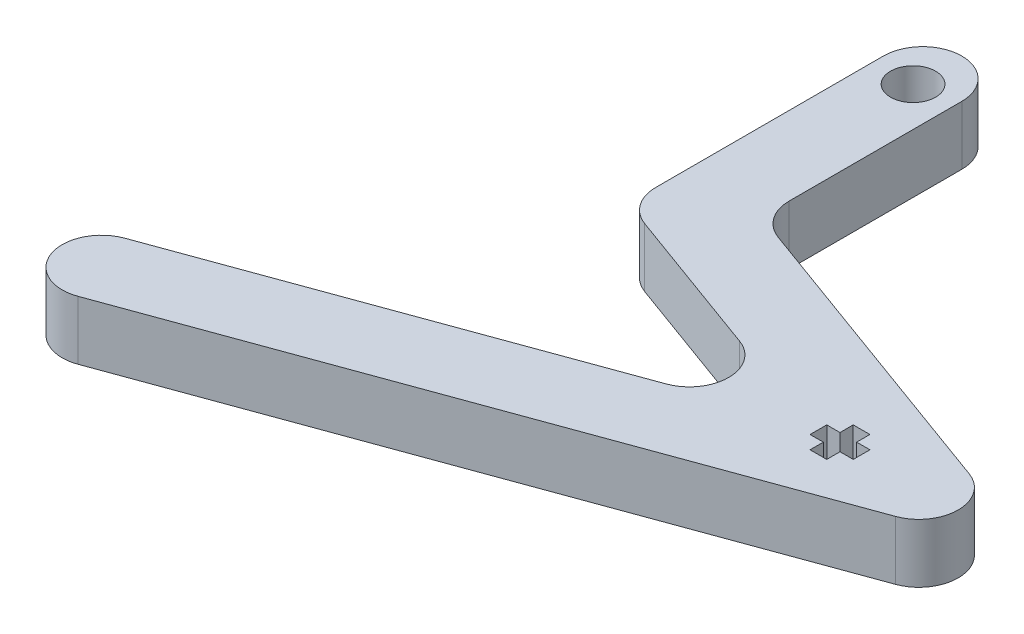
ISO-10303-21;
HEADER;
FILE_DESCRIPTION(('STEP AP214'),'2;1');
FILE_NAME('part.step','',(''),(''),'','','');
FILE_SCHEMA(('AUTOMOTIVE_DESIGN { 1 0 10303 214 1 1 1 1 }'));
ENDSEC;
DATA;
#1=APPLICATION_CONTEXT('core data for automotive mechanical design processes');
#2=APPLICATION_PROTOCOL_DEFINITION('international standard','automotive_design',2000,#1);
#3=PRODUCT_CONTEXT('',#1,'mechanical');
#4=PRODUCT('Part','Part','',(#3));
#5=PRODUCT_RELATED_PRODUCT_CATEGORY('part','',(#4));
#6=PRODUCT_DEFINITION_FORMATION('','',#4);
#7=PRODUCT_DEFINITION_CONTEXT('part definition',#1,'design');
#8=PRODUCT_DEFINITION('design','',#6,#7);
#9=PRODUCT_DEFINITION_SHAPE('','',#8);
#10=(LENGTH_UNIT() NAMED_UNIT(*) SI_UNIT(.MILLI.,.METRE.));
#11=(NAMED_UNIT(*) PLANE_ANGLE_UNIT() SI_UNIT($,.RADIAN.));
#12=(NAMED_UNIT(*) SI_UNIT($,.STERADIAN.) SOLID_ANGLE_UNIT());
#13=UNCERTAINTY_MEASURE_WITH_UNIT(LENGTH_MEASURE(1.E-05),#10,'distance_accuracy_value','');
#14=(GEOMETRIC_REPRESENTATION_CONTEXT(3) GLOBAL_UNCERTAINTY_ASSIGNED_CONTEXT((#13)) GLOBAL_UNIT_ASSIGNED_CONTEXT((#10,
#11,#12)) REPRESENTATION_CONTEXT('',''));
#15=CARTESIAN_POINT('',(0.,0.,0.));
#16=DIRECTION('',(0.,0.,1.));
#17=DIRECTION('',(1.,0.,0.));
#18=AXIS2_PLACEMENT_3D('',#15,#16,#17);
#19=CARTESIAN_POINT('',(0.,6.,0.));
#20=DIRECTION('',(0.,1.,0.));
#21=DIRECTION('',(0.,0.,1.));
#22=AXIS2_PLACEMENT_3D('',#19,#20,#21);
#23=PLANE('',#22);
#24=DIRECTION('',(0.,0.,1.));
#25=VECTOR('',#24,1.);
#26=CARTESIAN_POINT('',(-51.01093608651,6.,0.628871300436035));
#27=LINE('',#26,#25);
#28=CARTESIAN_POINT('',(-51.01093608651,6.,0.628871300436035));
#29=VERTEX_POINT('',#28);
#30=CARTESIAN_POINT('',(-51.01093608651,6.,2.32887130043603));
#31=VERTEX_POINT('',#30);
#32=EDGE_CURVE('E233',#29,#31,#27,.T.);
#33=ORIENTED_EDGE('',*,*,#32,.F.);
#34=DIRECTION('',(-1.,0.,0.));
#35=VECTOR('',#34,1.);
#36=CARTESIAN_POINT('',(-49.66093608651,6.,0.628871300436035));
#37=LINE('',#36,#35);
#38=CARTESIAN_POINT('',(-49.66093608651,6.,0.628871300436035));
#39=VERTEX_POINT('',#38);
#40=EDGE_CURVE('E222',#39,#29,#37,.T.);
#41=ORIENTED_EDGE('',*,*,#40,.F.);
#42=DIRECTION('',(0.,0.,1.));
#43=VECTOR('',#42,1.);
#44=CARTESIAN_POINT('',(-49.66093608651,6.,-0.721128699563966));
#45=LINE('',#44,#43);
#46=CARTESIAN_POINT('',(-49.66093608651,6.,-0.721128699563966));
#47=VERTEX_POINT('',#46);
#48=EDGE_CURVE('E279',#47,#39,#45,.T.);
#49=ORIENTED_EDGE('',*,*,#48,.F.);
#50=DIRECTION('',(-1.,0.,0.));
#51=VECTOR('',#50,1.);
#52=CARTESIAN_POINT('',(-47.96093608651,6.,-0.721128699563966));
#53=LINE('',#52,#51);
#54=CARTESIAN_POINT('',(-47.96093608651,6.,-0.721128699563966));
#55=VERTEX_POINT('',#54);
#56=EDGE_CURVE('E275',#55,#47,#53,.T.);
#57=ORIENTED_EDGE('',*,*,#56,.F.);
#58=DIRECTION('',(0.,0.,-1.));
#59=VECTOR('',#58,1.);
#60=CARTESIAN_POINT('',(-47.96093608651,6.,0.628871300436034));
#61=LINE('',#60,#59);
#62=CARTESIAN_POINT('',(-47.96093608651,6.,0.628871300436034));
#63=VERTEX_POINT('',#62);
#64=EDGE_CURVE('E272',#63,#55,#61,.T.);
#65=ORIENTED_EDGE('',*,*,#64,.F.);
#66=DIRECTION('',(-1.,0.,0.));
#67=VECTOR('',#66,1.);
#68=CARTESIAN_POINT('',(-46.61093608651,6.,0.628871300436034));
#69=LINE('',#68,#67);
#70=CARTESIAN_POINT('',(-46.61093608651,6.,0.628871300436034));
#71=VERTEX_POINT('',#70);
#72=EDGE_CURVE('E269',#71,#63,#69,.T.);
#73=ORIENTED_EDGE('',*,*,#72,.F.);
#74=DIRECTION('',(0.,0.,-1.));
#75=VECTOR('',#74,1.);
#76=CARTESIAN_POINT('',(-46.61093608651,6.,2.32887130043603));
#77=LINE('',#76,#75);
#78=CARTESIAN_POINT('',(-46.61093608651,6.,2.32887130043603));
#79=VERTEX_POINT('',#78);
#80=EDGE_CURVE('E266',#79,#71,#77,.T.);
#81=ORIENTED_EDGE('',*,*,#80,.F.);
#82=DIRECTION('',(1.,0.,0.));
#83=VECTOR('',#82,1.);
#84=CARTESIAN_POINT('',(-47.96093608651,6.,2.32887130043603));
#85=LINE('',#84,#83);
#86=CARTESIAN_POINT('',(-47.96093608651,6.,2.32887130043603));
#87=VERTEX_POINT('',#86);
#88=EDGE_CURVE('E263',#87,#79,#85,.T.);
#89=ORIENTED_EDGE('',*,*,#88,.F.);
#90=DIRECTION('',(0.,0.,-1.));
#91=VECTOR('',#90,1.);
#92=CARTESIAN_POINT('',(-47.96093608651,6.,3.67887130043604));
#93=LINE('',#92,#91);
#94=CARTESIAN_POINT('',(-47.96093608651,6.,3.67887130043604));
#95=VERTEX_POINT('',#94);
#96=EDGE_CURVE('E260',#95,#87,#93,.T.);
#97=ORIENTED_EDGE('',*,*,#96,.F.);
#98=DIRECTION('',(1.,0.,0.));
#99=VECTOR('',#98,1.);
#100=CARTESIAN_POINT('',(-49.66093608651,6.,3.67887130043604));
#101=LINE('',#100,#99);
#102=CARTESIAN_POINT('',(-49.66093608651,6.,3.67887130043604));
#103=VERTEX_POINT('',#102);
#104=EDGE_CURVE('E257',#103,#95,#101,.T.);
#105=ORIENTED_EDGE('',*,*,#104,.F.);
#106=DIRECTION('',(0.,0.,1.));
#107=VECTOR('',#106,1.);
#108=CARTESIAN_POINT('',(-49.66093608651,6.,2.32887130043603));
#109=LINE('',#108,#107);
#110=CARTESIAN_POINT('',(-49.66093608651,6.,2.32887130043603));
#111=VERTEX_POINT('',#110);
#112=EDGE_CURVE('E251',#111,#103,#109,.T.);
#113=ORIENTED_EDGE('',*,*,#112,.F.);
#114=DIRECTION('',(1.,0.,0.));
#115=VECTOR('',#114,1.);
#116=CARTESIAN_POINT('',(-51.01093608651,6.,2.32887130043603));
#117=LINE('',#116,#115);
#118=EDGE_CURVE('E247',#31,#111,#117,.T.);
#119=ORIENTED_EDGE('',*,*,#118,.F.);
#120=EDGE_LOOP('',(#33,#41,#49,#57,#65,#73,#81,#89,#97,#105,#113,#119));
#121=FACE_BOUND('',#120,.T.);
#122=DIRECTION('',(0.,0.,1.));
#123=VECTOR('',#122,1.);
#124=CARTESIAN_POINT('',(-80.6847805155405,6.,-38.8147085200845));
#125=LINE('',#124,#123);
#126=CARTESIAN_POINT('',(-80.6847805155405,6.,-34.8147085200845));
#127=VERTEX_POINT('',#126);
#128=CARTESIAN_POINT('',(-80.6847805155405,6.,-11.6155386729233));
#129=VERTEX_POINT('',#128);
#130=EDGE_CURVE('E358',#127,#129,#125,.T.);
#131=ORIENTED_EDGE('',*,*,#130,.T.);
#132=CARTESIAN_POINT('',(-76.6847805155405,6.,-11.6155386729233));
#133=DIRECTION('',(0.,1.,0.));
#134=DIRECTION('',(0.,0.,1.));
#135=AXIS2_PLACEMENT_3D('',#132,#133,#134);
#136=CIRCLE('',#135,4.);
#137=CARTESIAN_POINT('',(-78.0528610888432,6.,-7.85676818977966));
#138=VERTEX_POINT('',#137);
#139=EDGE_CURVE('E463',#129,#138,#136,.T.);
#140=ORIENTED_EDGE('',*,*,#139,.T.);
#141=DIRECTION('',(0.939692620785907,0.,0.342020143325673));
#142=VECTOR('',#141,1.);
#143=CARTESIAN_POINT('',(-80.6847805155405,6.,-8.81470852008446));
#144=LINE('',#143,#142);
#145=CARTESIAN_POINT('',(-62.821138919313,6.,-2.31287470345799));
#146=VERTEX_POINT('',#145);
#147=EDGE_CURVE('E362',#138,#146,#144,.T.);
#148=ORIENTED_EDGE('',*,*,#147,.T.);
#149=CARTESIAN_POINT('',(-64.1892194926157,6.,1.44589577968564));
#150=DIRECTION('',(0.,1.,0.));
#151=DIRECTION('',(0.,0.,1.));
#152=AXIS2_PLACEMENT_3D('',#149,#150,#151);
#153=CIRCLE('',#152,4.);
#154=CARTESIAN_POINT('',(-62.8211389193131,6.,5.20466626282928));
#155=VERTEX_POINT('',#154);
#156=EDGE_CURVE('E11',#146,#155,#153,.F.);
#157=ORIENTED_EDGE('',*,*,#156,.T.);
#158=DIRECTION('',(-0.939692620785912,0.,0.342020143325659));
#159=VECTOR('',#158,1.);
#160=CARTESIAN_POINT('',(-52.4940018919633,6.,1.44589577968572));
#161=LINE('',#160,#159);
#162=CARTESIAN_POINT('',(-103.256367016993,6.,19.9218857061487));
#163=VERTEX_POINT('',#162);
#164=EDGE_CURVE('E367',#155,#163,#161,.T.);
#165=ORIENTED_EDGE('',*,*,#164,.T.);
#166=CARTESIAN_POINT('',(-101.88828644369,6.,23.6806561892924));
#167=DIRECTION('',(0.,1.,0.));
#168=DIRECTION('',(0.,0.,1.));
#169=AXIS2_PLACEMENT_3D('',#166,#167,#168);
#170=CIRCLE('',#169,4.);
#171=CARTESIAN_POINT('',(-105.647056926834,6.,25.048736762595));
#172=VERTEX_POINT('',#171);
#173=EDGE_CURVE('E458',#163,#172,#170,.T.);
#174=ORIENTED_EDGE('',*,*,#173,.T.);
#175=CARTESIAN_POINT('',(-101.88828644369,6.,23.6806561892924));
#176=DIRECTION('',(0.,1.,0.));
#177=DIRECTION('',(0.,0.,1.));
#178=AXIS2_PLACEMENT_3D('',#175,#176,#177);
#179=CIRCLE('',#178,4.);
#180=CARTESIAN_POINT('',(-100.520205870388,6.,27.439426672436));
#181=VERTEX_POINT('',#180);
#182=EDGE_CURVE('E70',#172,#181,#179,.T.);
#183=ORIENTED_EDGE('',*,*,#182,.T.);
#184=DIRECTION('',(0.939692620785912,0.,-0.342020143325659));
#185=VECTOR('',#184,1.);
#186=CARTESIAN_POINT('',(-104.278976353531,6.,28.8075072457386));
#187=LINE('',#186,#185);
#188=CARTESIAN_POINT('',(-39.4307037180082,6.,5.20466626282944));
#189=VERTEX_POINT('',#188);
#190=EDGE_CURVE('E371',#181,#189,#187,.T.);
#191=ORIENTED_EDGE('',*,*,#190,.T.);
#192=CARTESIAN_POINT('',(-40.7987842913109,6.,1.44589577968579));
#193=DIRECTION('',(0.,1.,0.));
#194=DIRECTION('',(0.,0.,1.));
#195=AXIS2_PLACEMENT_3D('',#192,#193,#194);
#196=CIRCLE('',#195,4.);
#197=CARTESIAN_POINT('',(-39.4307037180082,6.,-2.31287470345783));
#198=VERTEX_POINT('',#197);
#199=EDGE_CURVE('E455',#189,#198,#196,.T.);
#200=ORIENTED_EDGE('',*,*,#199,.T.);
#201=DIRECTION('',(-0.939692620785907,0.,-0.342020143325673));
#202=VECTOR('',#201,1.);
#203=CARTESIAN_POINT('',(-72.6847805155405,6.,-14.4163688257621));
#204=LINE('',#203,#202);
#205=CARTESIAN_POINT('',(-70.0528610888432,6.,-13.4584284954573));
#206=VERTEX_POINT('',#205);
#207=EDGE_CURVE('E374',#198,#206,#204,.T.);
#208=ORIENTED_EDGE('',*,*,#207,.T.);
#209=CARTESIAN_POINT('',(-68.6847805155405,6.,-17.2171989786009));
#210=DIRECTION('',(0.,1.,0.));
#211=DIRECTION('',(0.,0.,1.));
#212=AXIS2_PLACEMENT_3D('',#209,#210,#211);
#213=CIRCLE('',#212,4.);
#214=CARTESIAN_POINT('',(-72.6847805155405,6.,-17.2171989786009));
#215=VERTEX_POINT('',#214);
#216=EDGE_CURVE('E482',#206,#215,#213,.F.);
#217=ORIENTED_EDGE('',*,*,#216,.T.);
#218=DIRECTION('',(0.,0.,-1.));
#219=VECTOR('',#218,1.);
#220=CARTESIAN_POINT('',(-72.6847805155405,6.,-14.4163688257621));
#221=LINE('',#220,#219);
#222=CARTESIAN_POINT('',(-72.6847805155405,6.,-34.8147085200845));
#223=VERTEX_POINT('',#222);
#224=EDGE_CURVE('E378',#215,#223,#221,.T.);
#225=ORIENTED_EDGE('',*,*,#224,.T.);
#226=CARTESIAN_POINT('',(-76.6847805155405,6.,-34.8147085200845));
#227=DIRECTION('',(0.,1.,0.));
#228=DIRECTION('',(0.,0.,1.));
#229=AXIS2_PLACEMENT_3D('',#226,#227,#228);
#230=CIRCLE('',#229,4.);
#231=CARTESIAN_POINT('',(-76.6847805155405,6.,-38.8147085200845));
#232=VERTEX_POINT('',#231);
#233=EDGE_CURVE('E452',#223,#232,#230,.T.);
#234=ORIENTED_EDGE('',*,*,#233,.T.);
#235=CARTESIAN_POINT('',(-76.6847805155405,6.,-34.8147085200845));
#236=DIRECTION('',(0.,1.,0.));
#237=DIRECTION('',(0.,0.,1.));
#238=AXIS2_PLACEMENT_3D('',#235,#236,#237);
#239=CIRCLE('',#238,4.);
#240=EDGE_CURVE('E449',#232,#127,#239,.T.);
#241=ORIENTED_EDGE('',*,*,#240,.T.);
#242=EDGE_LOOP('',(#131,#140,#148,#157,#165,#174,#183,#191,#200,#208,#217,#225,#234,#241));
#243=FACE_BOUND('',#242,.T.);
#244=CARTESIAN_POINT('',(-76.6847805155405,6.,-33.8437395424642));
#245=DIRECTION('',(0.,1.,0.));
#246=DIRECTION('',(0.,0.,1.));
#247=AXIS2_PLACEMENT_3D('',#244,#245,#246);
#248=CIRCLE('',#247,2.29999999999999);
#249=CARTESIAN_POINT('',(-76.6847805155405,6.,-31.5437395424643));
#250=VERTEX_POINT('',#249);
#251=EDGE_CURVE('E285',#250,#250,#248,.T.);
#252=ORIENTED_EDGE('',*,*,#251,.F.);
#253=EDGE_LOOP('',(#252));
#254=FACE_BOUND('',#253,.T.);
#255=ADVANCED_FACE('F45',(#121,#243,#254),#23,.T.);
#256=CARTESIAN_POINT('',(0.,0.,0.));
#257=DIRECTION('',(0.,1.,0.));
#258=DIRECTION('',(0.,0.,1.));
#259=AXIS2_PLACEMENT_3D('',#256,#257,#258);
#260=PLANE('',#259);
#261=DIRECTION('',(0.939692620785907,0.,0.342020143325673));
#262=VECTOR('',#261,1.);
#263=CARTESIAN_POINT('',(-80.6847805155405,0.,-8.81470852008446));
#264=LINE('',#263,#262);
#265=CARTESIAN_POINT('',(-78.0528610888432,0.,-7.85676818977966));
#266=VERTEX_POINT('',#265);
#267=CARTESIAN_POINT('',(-62.821138919313,0.,-2.31287470345799));
#268=VERTEX_POINT('',#267);
#269=EDGE_CURVE('E386',#266,#268,#264,.T.);
#270=ORIENTED_EDGE('',*,*,#269,.F.);
#271=CARTESIAN_POINT('',(-76.6847805155405,0.,-11.6155386729233));
#272=DIRECTION('',(0.,1.,0.));
#273=DIRECTION('',(0.,0.,1.));
#274=AXIS2_PLACEMENT_3D('',#271,#272,#273);
#275=CIRCLE('',#274,4.);
#276=CARTESIAN_POINT('',(-80.6847805155405,0.,-11.6155386729233));
#277=VERTEX_POINT('',#276);
#278=EDGE_CURVE('E440',#266,#277,#275,.F.);
#279=ORIENTED_EDGE('',*,*,#278,.T.);
#280=DIRECTION('',(0.,0.,1.));
#281=VECTOR('',#280,1.);
#282=CARTESIAN_POINT('',(-80.6847805155405,0.,-38.8147085200845));
#283=LINE('',#282,#281);
#284=CARTESIAN_POINT('',(-80.6847805155405,0.,-34.8147085200845));
#285=VERTEX_POINT('',#284);
#286=EDGE_CURVE('E242',#285,#277,#283,.T.);
#287=ORIENTED_EDGE('',*,*,#286,.F.);
#288=CARTESIAN_POINT('',(-76.6847805155405,0.,-34.8147085200845));
#289=DIRECTION('',(0.,1.,0.));
#290=DIRECTION('',(0.,0.,1.));
#291=AXIS2_PLACEMENT_3D('',#288,#289,#290);
#292=CIRCLE('',#291,4.);
#293=CARTESIAN_POINT('',(-76.6847805155405,0.,-38.8147085200845));
#294=VERTEX_POINT('',#293);
#295=EDGE_CURVE('E425',#285,#294,#292,.F.);
#296=ORIENTED_EDGE('',*,*,#295,.T.);
#297=CARTESIAN_POINT('',(-76.6847805155405,0.,-34.8147085200845));
#298=DIRECTION('',(0.,1.,0.));
#299=DIRECTION('',(0.,0.,1.));
#300=AXIS2_PLACEMENT_3D('',#297,#298,#299);
#301=CIRCLE('',#300,4.);
#302=CARTESIAN_POINT('',(-72.6847805155405,0.,-34.8147085200845));
#303=VERTEX_POINT('',#302);
#304=EDGE_CURVE('E428',#294,#303,#301,.F.);
#305=ORIENTED_EDGE('',*,*,#304,.T.);
#306=DIRECTION('',(0.,0.,-1.));
#307=VECTOR('',#306,1.);
#308=CARTESIAN_POINT('',(-72.6847805155405,0.,-14.4163688257621));
#309=LINE('',#308,#307);
#310=CARTESIAN_POINT('',(-72.6847805155405,0.,-17.2171989786009));
#311=VERTEX_POINT('',#310);
#312=EDGE_CURVE('E363',#311,#303,#309,.T.);
#313=ORIENTED_EDGE('',*,*,#312,.F.);
#314=CARTESIAN_POINT('',(-68.6847805155405,0.,-17.2171989786009));
#315=DIRECTION('',(0.,1.,0.));
#316=DIRECTION('',(0.,0.,1.));
#317=AXIS2_PLACEMENT_3D('',#314,#315,#316);
#318=CIRCLE('',#317,4.);
#319=CARTESIAN_POINT('',(-70.0528610888432,0.,-13.4584284954573));
#320=VERTEX_POINT('',#319);
#321=EDGE_CURVE('E479',#311,#320,#318,.T.);
#322=ORIENTED_EDGE('',*,*,#321,.T.);
#323=DIRECTION('',(-0.939692620785907,0.,-0.342020143325673));
#324=VECTOR('',#323,1.);
#325=CARTESIAN_POINT('',(-72.6847805155405,0.,-14.4163688257621));
#326=LINE('',#325,#324);
#327=CARTESIAN_POINT('',(-39.4307037180082,0.,-2.31287470345783));
#328=VERTEX_POINT('',#327);
#329=EDGE_CURVE('E397',#328,#320,#326,.T.);
#330=ORIENTED_EDGE('',*,*,#329,.F.);
#331=CARTESIAN_POINT('',(-40.7987842913109,0.,1.44589577968579));
#332=DIRECTION('',(0.,1.,0.));
#333=DIRECTION('',(0.,0.,1.));
#334=AXIS2_PLACEMENT_3D('',#331,#332,#333);
#335=CIRCLE('',#334,4.);
#336=CARTESIAN_POINT('',(-39.4307037180082,0.,5.20466626282944));
#337=VERTEX_POINT('',#336);
#338=EDGE_CURVE('E431',#328,#337,#335,.F.);
#339=ORIENTED_EDGE('',*,*,#338,.T.);
#340=DIRECTION('',(0.939692620785912,0.,-0.342020143325659));
#341=VECTOR('',#340,1.);
#342=CARTESIAN_POINT('',(-104.278976353531,0.,28.8075072457386));
#343=LINE('',#342,#341);
#344=CARTESIAN_POINT('',(-100.520205870388,0.,27.439426672436));
#345=VERTEX_POINT('',#344);
#346=EDGE_CURVE('E394',#345,#337,#343,.T.);
#347=ORIENTED_EDGE('',*,*,#346,.F.);
#348=CARTESIAN_POINT('',(-101.88828644369,0.,23.6806561892924));
#349=DIRECTION('',(0.,1.,0.));
#350=DIRECTION('',(0.,0.,1.));
#351=AXIS2_PLACEMENT_3D('',#348,#349,#350);
#352=CIRCLE('',#351,4.);
#353=CARTESIAN_POINT('',(-105.647056926834,0.,25.048736762595));
#354=VERTEX_POINT('',#353);
#355=EDGE_CURVE('E437',#345,#354,#352,.F.);
#356=ORIENTED_EDGE('',*,*,#355,.T.);
#357=CARTESIAN_POINT('',(-101.88828644369,0.,23.6806561892924));
#358=DIRECTION('',(0.,1.,0.));
#359=DIRECTION('',(0.,0.,1.));
#360=AXIS2_PLACEMENT_3D('',#357,#358,#359);
#361=CIRCLE('',#360,4.);
#362=CARTESIAN_POINT('',(-103.256367016993,0.,19.9218857061487));
#363=VERTEX_POINT('',#362);
#364=EDGE_CURVE('E434',#354,#363,#361,.F.);
#365=ORIENTED_EDGE('',*,*,#364,.T.);
#366=DIRECTION('',(-0.939692620785912,0.,0.342020143325659));
#367=VECTOR('',#366,1.);
#368=CARTESIAN_POINT('',(-52.4940018919633,0.,1.44589577968572));
#369=LINE('',#368,#367);
#370=CARTESIAN_POINT('',(-62.8211389193131,0.,5.20466626282928));
#371=VERTEX_POINT('',#370);
#372=EDGE_CURVE('E390',#371,#363,#369,.T.);
#373=ORIENTED_EDGE('',*,*,#372,.F.);
#374=CARTESIAN_POINT('',(-64.1892194926157,0.,1.44589577968564));
#375=DIRECTION('',(0.,1.,0.));
#376=DIRECTION('',(0.,0.,1.));
#377=AXIS2_PLACEMENT_3D('',#374,#375,#376);
#378=CIRCLE('',#377,4.);
#379=EDGE_CURVE('E55',#371,#268,#378,.T.);
#380=ORIENTED_EDGE('',*,*,#379,.T.);
#381=EDGE_LOOP('',(#270,#279,#287,#296,#305,#313,#322,#330,#339,#347,#356,#365,#373,#380));
#382=FACE_BOUND('',#381,.T.);
#383=DIRECTION('',(-1.,0.,0.));
#384=VECTOR('',#383,1.);
#385=CARTESIAN_POINT('',(-49.66093608651,0.,0.628871300436035));
#386=LINE('',#385,#384);
#387=CARTESIAN_POINT('',(-49.66093608651,0.,0.628871300436035));
#388=VERTEX_POINT('',#387);
#389=CARTESIAN_POINT('',(-51.01093608651,0.,0.628871300436035));
#390=VERTEX_POINT('',#389);
#391=EDGE_CURVE('E282',#388,#390,#386,.T.);
#392=ORIENTED_EDGE('',*,*,#391,.T.);
#393=DIRECTION('',(0.,0.,1.));
#394=VECTOR('',#393,1.);
#395=CARTESIAN_POINT('',(-51.01093608651,0.,0.628871300436035));
#396=LINE('',#395,#394);
#397=CARTESIAN_POINT('',(-51.01093608651,0.,2.32887130043603));
#398=VERTEX_POINT('',#397);
#399=EDGE_CURVE('E240',#390,#398,#396,.T.);
#400=ORIENTED_EDGE('',*,*,#399,.T.);
#401=DIRECTION('',(1.,0.,0.));
#402=VECTOR('',#401,1.);
#403=CARTESIAN_POINT('',(-51.01093608651,0.,2.32887130043603));
#404=LINE('',#403,#402);
#405=CARTESIAN_POINT('',(-49.66093608651,0.,2.32887130043603));
#406=VERTEX_POINT('',#405);
#407=EDGE_CURVE('E288',#398,#406,#404,.T.);
#408=ORIENTED_EDGE('',*,*,#407,.T.);
#409=DIRECTION('',(0.,0.,1.));
#410=VECTOR('',#409,1.);
#411=CARTESIAN_POINT('',(-49.66093608651,0.,2.32887130043603));
#412=LINE('',#411,#410);
#413=CARTESIAN_POINT('',(-49.66093608651,0.,3.67887130043604));
#414=VERTEX_POINT('',#413);
#415=EDGE_CURVE('E292',#406,#414,#412,.T.);
#416=ORIENTED_EDGE('',*,*,#415,.T.);
#417=DIRECTION('',(1.,0.,0.));
#418=VECTOR('',#417,1.);
#419=CARTESIAN_POINT('',(-49.66093608651,0.,3.67887130043604));
#420=LINE('',#419,#418);
#421=CARTESIAN_POINT('',(-47.96093608651,0.,3.67887130043604));
#422=VERTEX_POINT('',#421);
#423=EDGE_CURVE('E296',#414,#422,#420,.T.);
#424=ORIENTED_EDGE('',*,*,#423,.T.);
#425=DIRECTION('',(0.,0.,-1.));
#426=VECTOR('',#425,1.);
#427=CARTESIAN_POINT('',(-47.96093608651,0.,3.67887130043604));
#428=LINE('',#427,#426);
#429=CARTESIAN_POINT('',(-47.96093608651,0.,2.32887130043603));
#430=VERTEX_POINT('',#429);
#431=EDGE_CURVE('E300',#422,#430,#428,.T.);
#432=ORIENTED_EDGE('',*,*,#431,.T.);
#433=DIRECTION('',(1.,0.,0.));
#434=VECTOR('',#433,1.);
#435=CARTESIAN_POINT('',(-47.96093608651,0.,2.32887130043603));
#436=LINE('',#435,#434);
#437=CARTESIAN_POINT('',(-46.61093608651,0.,2.32887130043603));
#438=VERTEX_POINT('',#437);
#439=EDGE_CURVE('E304',#430,#438,#436,.T.);
#440=ORIENTED_EDGE('',*,*,#439,.T.);
#441=DIRECTION('',(0.,0.,-1.));
#442=VECTOR('',#441,1.);
#443=CARTESIAN_POINT('',(-46.61093608651,0.,2.32887130043603));
#444=LINE('',#443,#442);
#445=CARTESIAN_POINT('',(-46.61093608651,0.,0.628871300436034));
#446=VERTEX_POINT('',#445);
#447=EDGE_CURVE('E308',#438,#446,#444,.T.);
#448=ORIENTED_EDGE('',*,*,#447,.T.);
#449=DIRECTION('',(-1.,0.,0.));
#450=VECTOR('',#449,1.);
#451=CARTESIAN_POINT('',(-46.61093608651,0.,0.628871300436034));
#452=LINE('',#451,#450);
#453=CARTESIAN_POINT('',(-47.96093608651,0.,0.628871300436034));
#454=VERTEX_POINT('',#453);
#455=EDGE_CURVE('E312',#446,#454,#452,.T.);
#456=ORIENTED_EDGE('',*,*,#455,.T.);
#457=DIRECTION('',(0.,0.,-1.));
#458=VECTOR('',#457,1.);
#459=CARTESIAN_POINT('',(-47.96093608651,0.,0.628871300436034));
#460=LINE('',#459,#458);
#461=CARTESIAN_POINT('',(-47.96093608651,0.,-0.721128699563966));
#462=VERTEX_POINT('',#461);
#463=EDGE_CURVE('E316',#454,#462,#460,.T.);
#464=ORIENTED_EDGE('',*,*,#463,.T.);
#465=DIRECTION('',(-1.,0.,0.));
#466=VECTOR('',#465,1.);
#467=CARTESIAN_POINT('',(-47.96093608651,0.,-0.721128699563966));
#468=LINE('',#467,#466);
#469=CARTESIAN_POINT('',(-49.66093608651,0.,-0.721128699563966));
#470=VERTEX_POINT('',#469);
#471=EDGE_CURVE('E320',#462,#470,#468,.T.);
#472=ORIENTED_EDGE('',*,*,#471,.T.);
#473=DIRECTION('',(0.,0.,1.));
#474=VECTOR('',#473,1.);
#475=CARTESIAN_POINT('',(-49.66093608651,0.,-0.721128699563966));
#476=LINE('',#475,#474);
#477=EDGE_CURVE('E234',#470,#388,#476,.T.);
#478=ORIENTED_EDGE('',*,*,#477,.T.);
#479=EDGE_LOOP('',(#392,#400,#408,#416,#424,#432,#440,#448,#456,#464,#472,#478));
#480=FACE_BOUND('',#479,.T.);
#481=CARTESIAN_POINT('',(-76.6847805155405,0.,-33.8437395424642));
#482=DIRECTION('',(0.,1.,0.));
#483=DIRECTION('',(0.,0.,1.));
#484=AXIS2_PLACEMENT_3D('',#481,#482,#483);
#485=CIRCLE('',#484,2.29999999999999);
#486=CARTESIAN_POINT('',(-76.6847805155405,0.,-31.5437395424643));
#487=VERTEX_POINT('',#486);
#488=EDGE_CURVE('E489',#487,#487,#485,.T.);
#489=ORIENTED_EDGE('',*,*,#488,.T.);
#490=EDGE_LOOP('',(#489));
#491=FACE_BOUND('',#490,.T.);
#492=ADVANCED_FACE('F538',(#382,#480,#491),#260,.F.);
#493=CARTESIAN_POINT('',(-80.6847805155405,6.,-38.8147085200845));
#494=DIRECTION('',(1.,0.,0.));
#495=DIRECTION('',(0.,0.,-1.));
#496=AXIS2_PLACEMENT_3D('',#493,#494,#495);
#497=PLANE('',#496);
#498=ORIENTED_EDGE('',*,*,#286,.T.);
#499=DIRECTION('',(0.,-1.,0.));
#500=VECTOR('',#499,1.);
#501=CARTESIAN_POINT('',(-80.6847805155405,6.,-11.6155386729233));
#502=LINE('',#501,#500);
#503=EDGE_CURVE('E446',#277,#129,#502,.F.);
#504=ORIENTED_EDGE('',*,*,#503,.T.);
#505=ORIENTED_EDGE('',*,*,#130,.F.);
#506=DIRECTION('',(0.,-1.,0.));
#507=VECTOR('',#506,1.);
#508=CARTESIAN_POINT('',(-80.6847805155405,6.,-34.8147085200845));
#509=LINE('',#508,#507);
#510=EDGE_CURVE('E443',#127,#285,#509,.T.);
#511=ORIENTED_EDGE('',*,*,#510,.T.);
#512=EDGE_LOOP('',(#498,#504,#505,#511));
#513=FACE_BOUND('',#512,.T.);
#514=ADVANCED_FACE('F509',(#513),#497,.F.);
#515=CARTESIAN_POINT('',(-80.6847805155405,6.,-8.81470852008446));
#516=DIRECTION('',(0.342020143325673,0.,-0.939692620785907));
#517=DIRECTION('',(-0.939692620785907,0.,-0.342020143325673));
#518=AXIS2_PLACEMENT_3D('',#515,#516,#517);
#519=PLANE('',#518);
#520=ORIENTED_EDGE('',*,*,#147,.F.);
#521=DIRECTION('',(0.,-1.,0.));
#522=VECTOR('',#521,1.);
#523=CARTESIAN_POINT('',(-78.0528610888432,6.,-7.85676818977966));
#524=LINE('',#523,#522);
#525=EDGE_CURVE('E421',#138,#266,#524,.T.);
#526=ORIENTED_EDGE('',*,*,#525,.T.);
#527=ORIENTED_EDGE('',*,*,#269,.T.);
#528=DIRECTION('',(0.,-1.,0.));
#529=VECTOR('',#528,1.);
#530=CARTESIAN_POINT('',(-62.821138919313,6.,-2.31287470345799));
#531=LINE('',#530,#529);
#532=EDGE_CURVE('E418',#268,#146,#531,.F.);
#533=ORIENTED_EDGE('',*,*,#532,.T.);
#534=EDGE_LOOP('',(#520,#526,#527,#533));
#535=FACE_BOUND('',#534,.T.);
#536=ADVANCED_FACE('F518',(#535),#519,.F.);
#537=CARTESIAN_POINT('',(-52.4940018919633,6.,1.44589577968572));
#538=DIRECTION('',(0.342020143325659,0.,0.939692620785912));
#539=DIRECTION('',(0.939692620785912,0.,-0.342020143325659));
#540=AXIS2_PLACEMENT_3D('',#537,#538,#539);
#541=PLANE('',#540);
#542=ORIENTED_EDGE('',*,*,#372,.T.);
#543=DIRECTION('',(0.,-1.,0.));
#544=VECTOR('',#543,1.);
#545=CARTESIAN_POINT('',(-103.256367016993,6.,19.9218857061487));
#546=LINE('',#545,#544);
#547=EDGE_CURVE('E476',#363,#163,#546,.F.);
#548=ORIENTED_EDGE('',*,*,#547,.T.);
#549=ORIENTED_EDGE('',*,*,#164,.F.);
#550=DIRECTION('',(0.,-1.,0.));
#551=VECTOR('',#550,1.);
#552=CARTESIAN_POINT('',(-62.8211389193131,0.,5.20466626282928));
#553=LINE('',#552,#551);
#554=EDGE_CURVE('E472',#155,#371,#553,.T.);
#555=ORIENTED_EDGE('',*,*,#554,.T.);
#556=EDGE_LOOP('',(#542,#548,#549,#555));
#557=FACE_BOUND('',#556,.T.);
#558=ADVANCED_FACE('F527',(#557),#541,.F.);
#559=CARTESIAN_POINT('',(-104.278976353531,6.,28.8075072457386));
#560=DIRECTION('',(-0.34202014332566,0.,-0.939692620785912));
#561=DIRECTION('',(-0.939692620785912,0.,0.34202014332566));
#562=AXIS2_PLACEMENT_3D('',#559,#560,#561);
#563=PLANE('',#562);
#564=ORIENTED_EDGE('',*,*,#190,.F.);
#565=DIRECTION('',(0.,-1.,0.));
#566=VECTOR('',#565,1.);
#567=CARTESIAN_POINT('',(-100.520205870388,6.,27.439426672436));
#568=LINE('',#567,#566);
#569=EDGE_CURVE('E468',#181,#345,#568,.T.);
#570=ORIENTED_EDGE('',*,*,#569,.T.);
#571=ORIENTED_EDGE('',*,*,#346,.T.);
#572=DIRECTION('',(0.,-1.,0.));
#573=VECTOR('',#572,1.);
#574=CARTESIAN_POINT('',(-39.4307037180082,6.,5.20466626282944));
#575=LINE('',#574,#573);
#576=EDGE_CURVE('E63',#337,#189,#575,.F.);
#577=ORIENTED_EDGE('',*,*,#576,.T.);
#578=EDGE_LOOP('',(#564,#570,#571,#577));
#579=FACE_BOUND('',#578,.T.);
#580=ADVANCED_FACE('F536',(#579),#563,.F.);
#581=CARTESIAN_POINT('',(-72.6847805155405,6.,-14.4163688257621));
#582=DIRECTION('',(-0.342020143325673,0.,0.939692620785907));
#583=DIRECTION('',(0.939692620785907,0.,0.342020143325673));
#584=AXIS2_PLACEMENT_3D('',#581,#582,#583);
#585=PLANE('',#584);
#586=ORIENTED_EDGE('',*,*,#329,.T.);
#587=DIRECTION('',(0.,-1.,0.));
#588=VECTOR('',#587,1.);
#589=CARTESIAN_POINT('',(-70.0528610888432,6.,-13.4584284954573));
#590=LINE('',#589,#588);
#591=EDGE_CURVE('E415',#320,#206,#590,.F.);
#592=ORIENTED_EDGE('',*,*,#591,.T.);
#593=ORIENTED_EDGE('',*,*,#207,.F.);
#594=DIRECTION('',(0.,-1.,0.));
#595=VECTOR('',#594,1.);
#596=CARTESIAN_POINT('',(-39.4307037180082,6.,-2.31287470345784));
#597=LINE('',#596,#595);
#598=EDGE_CURVE('E411',#198,#328,#597,.T.);
#599=ORIENTED_EDGE('',*,*,#598,.T.);
#600=EDGE_LOOP('',(#586,#592,#593,#599));
#601=FACE_BOUND('',#600,.T.);
#602=ADVANCED_FACE('F547',(#601),#585,.F.);
#603=CARTESIAN_POINT('',(-72.6847805155405,6.,-14.4163688257621));
#604=DIRECTION('',(-1.,0.,0.));
#605=DIRECTION('',(0.,0.,1.));
#606=AXIS2_PLACEMENT_3D('',#603,#604,#605);
#607=PLANE('',#606);
#608=ORIENTED_EDGE('',*,*,#224,.F.);
#609=DIRECTION('',(0.,-1.,0.));
#610=VECTOR('',#609,1.);
#611=CARTESIAN_POINT('',(-72.6847805155405,0.,-17.2171989786009));
#612=LINE('',#611,#610);
#613=EDGE_CURVE('E407',#215,#311,#612,.T.);
#614=ORIENTED_EDGE('',*,*,#613,.T.);
#615=ORIENTED_EDGE('',*,*,#312,.T.);
#616=DIRECTION('',(0.,-1.,0.));
#617=VECTOR('',#616,1.);
#618=CARTESIAN_POINT('',(-72.6847805155405,6.,-34.8147085200845));
#619=LINE('',#618,#617);
#620=EDGE_CURVE('E382',#303,#223,#619,.F.);
#621=ORIENTED_EDGE('',*,*,#620,.T.);
#622=EDGE_LOOP('',(#608,#614,#615,#621));
#623=FACE_BOUND('',#622,.T.);
#624=ADVANCED_FACE('F556',(#623),#607,.F.);
#625=CARTESIAN_POINT('',(-49.66093608651,6.,0.628871300436035));
#626=DIRECTION('',(0.,0.,1.));
#627=DIRECTION('',(1.,0.,0.));
#628=AXIS2_PLACEMENT_3D('',#625,#626,#627);
#629=PLANE('',#628);
#630=ORIENTED_EDGE('',*,*,#391,.F.);
#631=DIRECTION('',(0.,-1.,0.));
#632=VECTOR('',#631,1.);
#633=CARTESIAN_POINT('',(-49.66093608651,6.,0.628871300436035));
#634=LINE('',#633,#632);
#635=EDGE_CURVE('E228',#39,#388,#634,.T.);
#636=ORIENTED_EDGE('',*,*,#635,.F.);
#637=ORIENTED_EDGE('',*,*,#40,.T.);
#638=DIRECTION('',(0.,-1.,0.));
#639=VECTOR('',#638,1.);
#640=CARTESIAN_POINT('',(-51.01093608651,6.,0.628871300436035));
#641=LINE('',#640,#639);
#642=EDGE_CURVE('E225',#29,#390,#641,.T.);
#643=ORIENTED_EDGE('',*,*,#642,.T.);
#644=EDGE_LOOP('',(#630,#636,#637,#643));
#645=FACE_BOUND('',#644,.T.);
#646=ADVANCED_FACE('F224',(#645),#629,.T.);
#647=CARTESIAN_POINT('',(-51.01093608651,6.,0.628871300436035));
#648=DIRECTION('',(1.,0.,0.));
#649=DIRECTION('',(0.,0.,-1.));
#650=AXIS2_PLACEMENT_3D('',#647,#648,#649);
#651=PLANE('',#650);
#652=ORIENTED_EDGE('',*,*,#399,.F.);
#653=ORIENTED_EDGE('',*,*,#642,.F.);
#654=ORIENTED_EDGE('',*,*,#32,.T.);
#655=DIRECTION('',(0.,-1.,0.));
#656=VECTOR('',#655,1.);
#657=CARTESIAN_POINT('',(-51.01093608651,6.,2.32887130043603));
#658=LINE('',#657,#656);
#659=EDGE_CURVE('E243',#31,#398,#658,.T.);
#660=ORIENTED_EDGE('',*,*,#659,.T.);
#661=EDGE_LOOP('',(#652,#653,#654,#660));
#662=FACE_BOUND('',#661,.T.);
#663=ADVANCED_FACE('F237',(#662),#651,.T.);
#664=CARTESIAN_POINT('',(-51.01093608651,6.,2.32887130043603));
#665=DIRECTION('',(0.,0.,-1.));
#666=DIRECTION('',(-1.,0.,0.));
#667=AXIS2_PLACEMENT_3D('',#664,#665,#666);
#668=PLANE('',#667);
#669=ORIENTED_EDGE('',*,*,#407,.F.);
#670=ORIENTED_EDGE('',*,*,#659,.F.);
#671=ORIENTED_EDGE('',*,*,#118,.T.);
#672=DIRECTION('',(0.,-1.,0.));
#673=VECTOR('',#672,1.);
#674=CARTESIAN_POINT('',(-49.66093608651,6.,2.32887130043603));
#675=LINE('',#674,#673);
#676=EDGE_CURVE('E353',#111,#406,#675,.T.);
#677=ORIENTED_EDGE('',*,*,#676,.T.);
#678=EDGE_LOOP('',(#669,#670,#671,#677));
#679=FACE_BOUND('',#678,.T.);
#680=ADVANCED_FACE('F576',(#679),#668,.T.);
#681=CARTESIAN_POINT('',(-49.66093608651,6.,2.32887130043603));
#682=DIRECTION('',(1.,0.,0.));
#683=DIRECTION('',(0.,0.,-1.));
#684=AXIS2_PLACEMENT_3D('',#681,#682,#683);
#685=PLANE('',#684);
#686=ORIENTED_EDGE('',*,*,#415,.F.);
#687=ORIENTED_EDGE('',*,*,#676,.F.);
#688=ORIENTED_EDGE('',*,*,#112,.T.);
#689=DIRECTION('',(0.,-1.,0.));
#690=VECTOR('',#689,1.);
#691=CARTESIAN_POINT('',(-49.66093608651,6.,3.67887130043604));
#692=LINE('',#691,#690);
#693=EDGE_CURVE('E350',#103,#414,#692,.T.);
#694=ORIENTED_EDGE('',*,*,#693,.T.);
#695=EDGE_LOOP('',(#686,#687,#688,#694));
#696=FACE_BOUND('',#695,.T.);
#697=ADVANCED_FACE('F579',(#696),#685,.T.);
#698=CARTESIAN_POINT('',(-49.66093608651,6.,3.67887130043604));
#699=DIRECTION('',(0.,0.,-1.));
#700=DIRECTION('',(-1.,0.,0.));
#701=AXIS2_PLACEMENT_3D('',#698,#699,#700);
#702=PLANE('',#701);
#703=ORIENTED_EDGE('',*,*,#423,.F.);
#704=ORIENTED_EDGE('',*,*,#693,.F.);
#705=ORIENTED_EDGE('',*,*,#104,.T.);
#706=DIRECTION('',(0.,-1.,0.));
#707=VECTOR('',#706,1.);
#708=CARTESIAN_POINT('',(-47.96093608651,6.,3.67887130043604));
#709=LINE('',#708,#707);
#710=EDGE_CURVE('E347',#95,#422,#709,.T.);
#711=ORIENTED_EDGE('',*,*,#710,.T.);
#712=EDGE_LOOP('',(#703,#704,#705,#711));
#713=FACE_BOUND('',#712,.T.);
#714=ADVANCED_FACE('F583',(#713),#702,.T.);
#715=CARTESIAN_POINT('',(-47.96093608651,6.,3.67887130043604));
#716=DIRECTION('',(-1.,0.,0.));
#717=DIRECTION('',(0.,0.,1.));
#718=AXIS2_PLACEMENT_3D('',#715,#716,#717);
#719=PLANE('',#718);
#720=ORIENTED_EDGE('',*,*,#431,.F.);
#721=ORIENTED_EDGE('',*,*,#710,.F.);
#722=ORIENTED_EDGE('',*,*,#96,.T.);
#723=DIRECTION('',(0.,-1.,0.));
#724=VECTOR('',#723,1.);
#725=CARTESIAN_POINT('',(-47.96093608651,6.,2.32887130043603));
#726=LINE('',#725,#724);
#727=EDGE_CURVE('E344',#87,#430,#726,.T.);
#728=ORIENTED_EDGE('',*,*,#727,.T.);
#729=EDGE_LOOP('',(#720,#721,#722,#728));
#730=FACE_BOUND('',#729,.T.);
#731=ADVANCED_FACE('F587',(#730),#719,.T.);
#732=CARTESIAN_POINT('',(-47.96093608651,6.,2.32887130043603));
#733=DIRECTION('',(0.,0.,-1.));
#734=DIRECTION('',(-1.,0.,0.));
#735=AXIS2_PLACEMENT_3D('',#732,#733,#734);
#736=PLANE('',#735);
#737=ORIENTED_EDGE('',*,*,#439,.F.);
#738=ORIENTED_EDGE('',*,*,#727,.F.);
#739=ORIENTED_EDGE('',*,*,#88,.T.);
#740=DIRECTION('',(0.,-1.,0.));
#741=VECTOR('',#740,1.);
#742=CARTESIAN_POINT('',(-46.61093608651,6.,2.32887130043603));
#743=LINE('',#742,#741);
#744=EDGE_CURVE('E341',#79,#438,#743,.T.);
#745=ORIENTED_EDGE('',*,*,#744,.T.);
#746=EDGE_LOOP('',(#737,#738,#739,#745));
#747=FACE_BOUND('',#746,.T.);
#748=ADVANCED_FACE('F591',(#747),#736,.T.);
#749=CARTESIAN_POINT('',(-46.61093608651,6.,2.32887130043603));
#750=DIRECTION('',(-1.,0.,0.));
#751=DIRECTION('',(0.,0.,1.));
#752=AXIS2_PLACEMENT_3D('',#749,#750,#751);
#753=PLANE('',#752);
#754=ORIENTED_EDGE('',*,*,#447,.F.);
#755=ORIENTED_EDGE('',*,*,#744,.F.);
#756=ORIENTED_EDGE('',*,*,#80,.T.);
#757=DIRECTION('',(0.,-1.,0.));
#758=VECTOR('',#757,1.);
#759=CARTESIAN_POINT('',(-46.61093608651,6.,0.628871300436034));
#760=LINE('',#759,#758);
#761=EDGE_CURVE('E338',#71,#446,#760,.T.);
#762=ORIENTED_EDGE('',*,*,#761,.T.);
#763=EDGE_LOOP('',(#754,#755,#756,#762));
#764=FACE_BOUND('',#763,.T.);
#765=ADVANCED_FACE('F595',(#764),#753,.T.);
#766=CARTESIAN_POINT('',(-46.61093608651,6.,0.628871300436034));
#767=DIRECTION('',(0.,0.,1.));
#768=DIRECTION('',(1.,0.,0.));
#769=AXIS2_PLACEMENT_3D('',#766,#767,#768);
#770=PLANE('',#769);
#771=ORIENTED_EDGE('',*,*,#455,.F.);
#772=ORIENTED_EDGE('',*,*,#761,.F.);
#773=ORIENTED_EDGE('',*,*,#72,.T.);
#774=DIRECTION('',(0.,-1.,0.));
#775=VECTOR('',#774,1.);
#776=CARTESIAN_POINT('',(-47.96093608651,6.,0.628871300436034));
#777=LINE('',#776,#775);
#778=EDGE_CURVE('E335',#63,#454,#777,.T.);
#779=ORIENTED_EDGE('',*,*,#778,.T.);
#780=EDGE_LOOP('',(#771,#772,#773,#779));
#781=FACE_BOUND('',#780,.T.);
#782=ADVANCED_FACE('F599',(#781),#770,.T.);
#783=CARTESIAN_POINT('',(-47.96093608651,6.,0.628871300436034));
#784=DIRECTION('',(-1.,0.,0.));
#785=DIRECTION('',(0.,0.,1.));
#786=AXIS2_PLACEMENT_3D('',#783,#784,#785);
#787=PLANE('',#786);
#788=ORIENTED_EDGE('',*,*,#463,.F.);
#789=ORIENTED_EDGE('',*,*,#778,.F.);
#790=ORIENTED_EDGE('',*,*,#64,.T.);
#791=DIRECTION('',(0.,-1.,0.));
#792=VECTOR('',#791,1.);
#793=CARTESIAN_POINT('',(-47.96093608651,6.,-0.721128699563966));
#794=LINE('',#793,#792);
#795=EDGE_CURVE('E332',#55,#462,#794,.T.);
#796=ORIENTED_EDGE('',*,*,#795,.T.);
#797=EDGE_LOOP('',(#788,#789,#790,#796));
#798=FACE_BOUND('',#797,.T.);
#799=ADVANCED_FACE('F603',(#798),#787,.T.);
#800=CARTESIAN_POINT('',(-47.96093608651,6.,-0.721128699563966));
#801=DIRECTION('',(0.,0.,1.));
#802=DIRECTION('',(1.,0.,0.));
#803=AXIS2_PLACEMENT_3D('',#800,#801,#802);
#804=PLANE('',#803);
#805=ORIENTED_EDGE('',*,*,#471,.F.);
#806=ORIENTED_EDGE('',*,*,#795,.F.);
#807=ORIENTED_EDGE('',*,*,#56,.T.);
#808=DIRECTION('',(0.,-1.,0.));
#809=VECTOR('',#808,1.);
#810=CARTESIAN_POINT('',(-49.66093608651,6.,-0.721128699563966));
#811=LINE('',#810,#809);
#812=EDGE_CURVE('E329',#47,#470,#811,.T.);
#813=ORIENTED_EDGE('',*,*,#812,.T.);
#814=EDGE_LOOP('',(#805,#806,#807,#813));
#815=FACE_BOUND('',#814,.T.);
#816=ADVANCED_FACE('F607',(#815),#804,.T.);
#817=CARTESIAN_POINT('',(-49.66093608651,6.,-0.721128699563966));
#818=DIRECTION('',(1.,0.,0.));
#819=DIRECTION('',(0.,0.,-1.));
#820=AXIS2_PLACEMENT_3D('',#817,#818,#819);
#821=PLANE('',#820);
#822=ORIENTED_EDGE('',*,*,#477,.F.);
#823=ORIENTED_EDGE('',*,*,#812,.F.);
#824=ORIENTED_EDGE('',*,*,#48,.T.);
#825=ORIENTED_EDGE('',*,*,#635,.T.);
#826=EDGE_LOOP('',(#822,#823,#824,#825));
#827=FACE_BOUND('',#826,.T.);
#828=ADVANCED_FACE('F611',(#827),#821,.T.);
#829=CARTESIAN_POINT('',(-76.6847805155405,6.,-33.8437395424642));
#830=DIRECTION('',(0.,-1.,0.));
#831=DIRECTION('',(0.,0.,-1.));
#832=AXIS2_PLACEMENT_3D('',#829,#830,#831);
#833=CYLINDRICAL_SURFACE('',#832,2.29999999999999);
#834=ORIENTED_EDGE('',*,*,#251,.T.);
#835=EDGE_LOOP('',(#834));
#836=FACE_BOUND('',#835,.T.);
#837=ORIENTED_EDGE('',*,*,#488,.F.);
#838=EDGE_LOOP('',(#837));
#839=FACE_BOUND('',#838,.T.);
#840=ADVANCED_FACE('F615',(#836,#839),#833,.F.);
#841=CARTESIAN_POINT('',(-68.6847805155405,6.,-17.2171989786009));
#842=DIRECTION('',(0.,1.,0.));
#843=DIRECTION('',(0.,0.,1.));
#844=AXIS2_PLACEMENT_3D('',#841,#842,#843);
#845=CYLINDRICAL_SURFACE('',#844,4.);
#846=ORIENTED_EDGE('',*,*,#216,.F.);
#847=ORIENTED_EDGE('',*,*,#591,.F.);
#848=ORIENTED_EDGE('',*,*,#321,.F.);
#849=ORIENTED_EDGE('',*,*,#613,.F.);
#850=EDGE_LOOP('',(#846,#847,#848,#849));
#851=FACE_BOUND('',#850,.T.);
#852=ADVANCED_FACE('F553',(#851),#845,.F.);
#853=CARTESIAN_POINT('',(-76.6847805155405,6.,-11.6155386729233));
#854=DIRECTION('',(0.,-1.,0.));
#855=DIRECTION('',(0.,0.,-1.));
#856=AXIS2_PLACEMENT_3D('',#853,#854,#855);
#857=CYLINDRICAL_SURFACE('',#856,4.);
#858=ORIENTED_EDGE('',*,*,#139,.F.);
#859=ORIENTED_EDGE('',*,*,#503,.F.);
#860=ORIENTED_EDGE('',*,*,#278,.F.);
#861=ORIENTED_EDGE('',*,*,#525,.F.);
#862=EDGE_LOOP('',(#858,#859,#860,#861));
#863=FACE_BOUND('',#862,.T.);
#864=ADVANCED_FACE('F513',(#863),#857,.T.);
#865=CARTESIAN_POINT('',(-101.88828644369,6.,23.6806561892924));
#866=DIRECTION('',(0.,-1.,0.));
#867=DIRECTION('',(0.,0.,-1.));
#868=AXIS2_PLACEMENT_3D('',#865,#866,#867);
#869=CYLINDRICAL_SURFACE('',#868,4.);
#870=DIRECTION('',(0.,-1.,0.));
#871=VECTOR('',#870,1.);
#872=CARTESIAN_POINT('',(-105.647056926834,6.,25.048736762595));
#873=LINE('',#872,#871);
#874=EDGE_CURVE('E486',#172,#354,#873,.T.);
#875=ORIENTED_EDGE('',*,*,#874,.F.);
#876=ORIENTED_EDGE('',*,*,#173,.F.);
#877=ORIENTED_EDGE('',*,*,#547,.F.);
#878=ORIENTED_EDGE('',*,*,#364,.F.);
#879=EDGE_LOOP('',(#875,#876,#877,#878));
#880=FACE_BOUND('',#879,.T.);
#881=ADVANCED_FACE('F532',(#880),#869,.T.);
#882=CARTESIAN_POINT('',(-101.88828644369,6.,23.6806561892924));
#883=DIRECTION('',(0.,-1.,0.));
#884=DIRECTION('',(0.,0.,-1.));
#885=AXIS2_PLACEMENT_3D('',#882,#883,#884);
#886=CYLINDRICAL_SURFACE('',#885,4.);
#887=ORIENTED_EDGE('',*,*,#182,.F.);
#888=ORIENTED_EDGE('',*,*,#874,.T.);
#889=ORIENTED_EDGE('',*,*,#355,.F.);
#890=ORIENTED_EDGE('',*,*,#569,.F.);
#891=EDGE_LOOP('',(#887,#888,#889,#890));
#892=FACE_BOUND('',#891,.T.);
#893=ADVANCED_FACE('F534',(#892),#886,.T.);
#894=CARTESIAN_POINT('',(-64.1892194926157,6.,1.44589577968564));
#895=DIRECTION('',(0.,1.,0.));
#896=DIRECTION('',(0.,0.,1.));
#897=AXIS2_PLACEMENT_3D('',#894,#895,#896);
#898=CYLINDRICAL_SURFACE('',#897,4.);
#899=ORIENTED_EDGE('',*,*,#156,.F.);
#900=ORIENTED_EDGE('',*,*,#532,.F.);
#901=ORIENTED_EDGE('',*,*,#379,.F.);
#902=ORIENTED_EDGE('',*,*,#554,.F.);
#903=EDGE_LOOP('',(#899,#900,#901,#902));
#904=FACE_BOUND('',#903,.T.);
#905=ADVANCED_FACE('F522',(#904),#898,.F.);
#906=CARTESIAN_POINT('',(-40.7987842913109,6.,1.44589577968579));
#907=DIRECTION('',(0.,-1.,0.));
#908=DIRECTION('',(0.,0.,-1.));
#909=AXIS2_PLACEMENT_3D('',#906,#907,#908);
#910=CYLINDRICAL_SURFACE('',#909,4.);
#911=ORIENTED_EDGE('',*,*,#199,.F.);
#912=ORIENTED_EDGE('',*,*,#576,.F.);
#913=ORIENTED_EDGE('',*,*,#338,.F.);
#914=ORIENTED_EDGE('',*,*,#598,.F.);
#915=EDGE_LOOP('',(#911,#912,#913,#914));
#916=FACE_BOUND('',#915,.T.);
#917=ADVANCED_FACE('F544',(#916),#910,.T.);
#918=CARTESIAN_POINT('',(-76.6847805155405,6.,-34.8147085200845));
#919=DIRECTION('',(0.,-1.,0.));
#920=DIRECTION('',(0.,0.,-1.));
#921=AXIS2_PLACEMENT_3D('',#918,#919,#920);
#922=CYLINDRICAL_SURFACE('',#921,4.);
#923=ORIENTED_EDGE('',*,*,#510,.F.);
#924=ORIENTED_EDGE('',*,*,#240,.F.);
#925=DIRECTION('',(0.,-1.,0.));
#926=VECTOR('',#925,1.);
#927=CARTESIAN_POINT('',(-76.6847805155405,6.,-38.8147085200845));
#928=LINE('',#927,#926);
#929=EDGE_CURVE('E49',#294,#232,#928,.F.);
#930=ORIENTED_EDGE('',*,*,#929,.F.);
#931=ORIENTED_EDGE('',*,*,#295,.F.);
#932=EDGE_LOOP('',(#923,#924,#930,#931));
#933=FACE_BOUND('',#932,.T.);
#934=ADVANCED_FACE('F47',(#933),#922,.T.);
#935=CARTESIAN_POINT('',(-76.6847805155405,6.,-34.8147085200845));
#936=DIRECTION('',(0.,-1.,0.));
#937=DIRECTION('',(0.,0.,-1.));
#938=AXIS2_PLACEMENT_3D('',#935,#936,#937);
#939=CYLINDRICAL_SURFACE('',#938,4.);
#940=ORIENTED_EDGE('',*,*,#233,.F.);
#941=ORIENTED_EDGE('',*,*,#620,.F.);
#942=ORIENTED_EDGE('',*,*,#304,.F.);
#943=ORIENTED_EDGE('',*,*,#929,.T.);
#944=EDGE_LOOP('',(#940,#941,#942,#943));
#945=FACE_BOUND('',#944,.T.);
#946=ADVANCED_FACE('F499',(#945),#939,.T.);
#947=CLOSED_SHELL('',(#255,#492,#514,#536,#558,#580,#602,#624,#646,#663,#680,#697,#714,#731,
#748,#765,#782,#799,#816,#828,#840,#852,#864,#881,#893,#905,#917,#934,#946));
#948=MANIFOLD_SOLID_BREP('B2',#947);
#949=ADVANCED_BREP_SHAPE_REPRESENTATION('',(#18,#948),#14);
#950=SHAPE_DEFINITION_REPRESENTATION(#9,#949);
ENDSEC;
END-ISO-10303-21;
